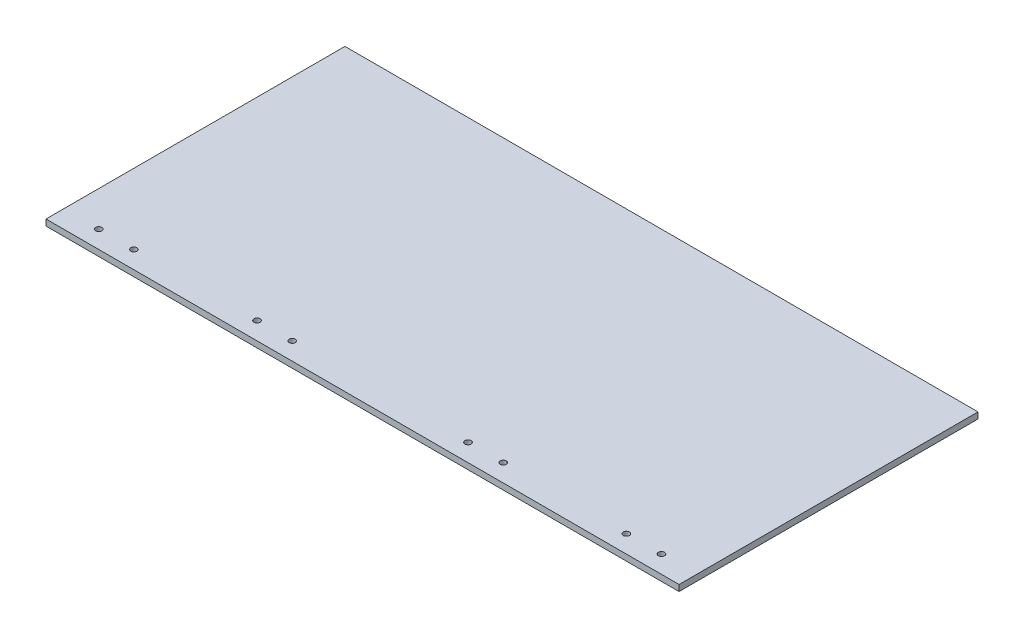
ISO-10303-21;
HEADER;
FILE_DESCRIPTION(('STEP AP214'),'2;1');
FILE_NAME('part.step','',(''),(''),'','','');
FILE_SCHEMA(('AUTOMOTIVE_DESIGN { 1 0 10303 214 1 1 1 1 }'));
ENDSEC;
DATA;
#1=APPLICATION_CONTEXT('core data for automotive mechanical design processes');
#2=APPLICATION_PROTOCOL_DEFINITION('international standard','automotive_design',2000,#1);
#3=PRODUCT_CONTEXT('',#1,'mechanical');
#4=PRODUCT('Part','Part','',(#3));
#5=PRODUCT_RELATED_PRODUCT_CATEGORY('part','',(#4));
#6=PRODUCT_DEFINITION_FORMATION('','',#4);
#7=PRODUCT_DEFINITION_CONTEXT('part definition',#1,'design');
#8=PRODUCT_DEFINITION('design','',#6,#7);
#9=PRODUCT_DEFINITION_SHAPE('','',#8);
#10=(LENGTH_UNIT() NAMED_UNIT(*) SI_UNIT(.MILLI.,.METRE.));
#11=(NAMED_UNIT(*) PLANE_ANGLE_UNIT() SI_UNIT($,.RADIAN.));
#12=(NAMED_UNIT(*) SI_UNIT($,.STERADIAN.) SOLID_ANGLE_UNIT());
#13=UNCERTAINTY_MEASURE_WITH_UNIT(LENGTH_MEASURE(1.E-05),#10,'distance_accuracy_value','');
#14=(GEOMETRIC_REPRESENTATION_CONTEXT(3) GLOBAL_UNCERTAINTY_ASSIGNED_CONTEXT((#13)) GLOBAL_UNIT_ASSIGNED_CONTEXT((#10,
#11,#12)) REPRESENTATION_CONTEXT('',''));
#15=CARTESIAN_POINT('',(0.,0.,0.));
#16=DIRECTION('',(0.,0.,1.));
#17=DIRECTION('',(1.,0.,0.));
#18=AXIS2_PLACEMENT_3D('',#15,#16,#17);
#19=CARTESIAN_POINT('',(0.,3.5,0.));
#20=DIRECTION('',(1.,0.,0.));
#21=DIRECTION('',(0.,0.,-1.));
#22=AXIS2_PLACEMENT_3D('',#19,#20,#21);
#23=PLANE('',#22);
#24=DIRECTION('',(0.,0.,1.));
#25=VECTOR('',#24,1.);
#26=CARTESIAN_POINT('',(0.,0.,0.));
#27=LINE('',#26,#25);
#28=CARTESIAN_POINT('',(0.,0.,-170.));
#29=VERTEX_POINT('',#28);
#30=CARTESIAN_POINT('',(0.,0.,0.));
#31=VERTEX_POINT('',#30);
#32=EDGE_CURVE('E96',#29,#31,#27,.T.);
#33=ORIENTED_EDGE('',*,*,#32,.T.);
#34=DIRECTION('',(0.,-1.,0.));
#35=VECTOR('',#34,1.);
#36=CARTESIAN_POINT('',(0.,3.5,0.));
#37=LINE('',#36,#35);
#38=CARTESIAN_POINT('',(0.,3.5,0.));
#39=VERTEX_POINT('',#38);
#40=EDGE_CURVE('E11',#39,#31,#37,.T.);
#41=ORIENTED_EDGE('',*,*,#40,.F.);
#42=DIRECTION('',(0.,0.,1.));
#43=VECTOR('',#42,1.);
#44=CARTESIAN_POINT('',(0.,3.5,0.));
#45=LINE('',#44,#43);
#46=CARTESIAN_POINT('',(0.,3.5,-170.));
#47=VERTEX_POINT('',#46);
#48=EDGE_CURVE('E84',#47,#39,#45,.T.);
#49=ORIENTED_EDGE('',*,*,#48,.F.);
#50=DIRECTION('',(0.,-1.,0.));
#51=VECTOR('',#50,1.);
#52=CARTESIAN_POINT('',(0.,3.5,-170.));
#53=LINE('',#52,#51);
#54=EDGE_CURVE('E92',#47,#29,#53,.T.);
#55=ORIENTED_EDGE('',*,*,#54,.T.);
#56=EDGE_LOOP('',(#33,#41,#49,#55));
#57=FACE_BOUND('',#56,.T.);
#58=ADVANCED_FACE('F33',(#57),#23,.F.);
#59=CARTESIAN_POINT('',(0.,3.5,0.));
#60=DIRECTION('',(0.,0.,-1.));
#61=DIRECTION('',(-1.,0.,0.));
#62=AXIS2_PLACEMENT_3D('',#59,#60,#61);
#63=PLANE('',#62);
#64=DIRECTION('',(1.,0.,0.));
#65=VECTOR('',#64,1.);
#66=CARTESIAN_POINT('',(0.,0.,0.));
#67=LINE('',#66,#65);
#68=CARTESIAN_POINT('',(360.,0.,0.));
#69=VERTEX_POINT('',#68);
#70=EDGE_CURVE('E88',#31,#69,#67,.T.);
#71=ORIENTED_EDGE('',*,*,#70,.T.);
#72=DIRECTION('',(0.,-1.,0.));
#73=VECTOR('',#72,1.);
#74=CARTESIAN_POINT('',(360.,3.5,0.));
#75=LINE('',#74,#73);
#76=CARTESIAN_POINT('',(360.,3.5,0.));
#77=VERTEX_POINT('',#76);
#78=EDGE_CURVE('E41',#77,#69,#75,.T.);
#79=ORIENTED_EDGE('',*,*,#78,.F.);
#80=DIRECTION('',(1.,0.,0.));
#81=VECTOR('',#80,1.);
#82=CARTESIAN_POINT('',(0.,3.5,0.));
#83=LINE('',#82,#81);
#84=EDGE_CURVE('E79',#39,#77,#83,.T.);
#85=ORIENTED_EDGE('',*,*,#84,.F.);
#86=ORIENTED_EDGE('',*,*,#40,.T.);
#87=EDGE_LOOP('',(#71,#79,#85,#86));
#88=FACE_BOUND('',#87,.T.);
#89=ADVANCED_FACE('F87',(#88),#63,.F.);
#90=CARTESIAN_POINT('',(360.,3.5,0.));
#91=DIRECTION('',(-1.,0.,0.));
#92=DIRECTION('',(0.,0.,1.));
#93=AXIS2_PLACEMENT_3D('',#90,#91,#92);
#94=PLANE('',#93);
#95=DIRECTION('',(0.,0.,-1.));
#96=VECTOR('',#95,1.);
#97=CARTESIAN_POINT('',(360.,0.,0.));
#98=LINE('',#97,#96);
#99=CARTESIAN_POINT('',(360.,0.,-170.));
#100=VERTEX_POINT('',#99);
#101=EDGE_CURVE('E66',#69,#100,#98,.T.);
#102=ORIENTED_EDGE('',*,*,#101,.T.);
#103=DIRECTION('',(0.,-1.,0.));
#104=VECTOR('',#103,1.);
#105=CARTESIAN_POINT('',(360.,3.5,-170.));
#106=LINE('',#105,#104);
#107=CARTESIAN_POINT('',(360.,3.5,-170.));
#108=VERTEX_POINT('',#107);
#109=EDGE_CURVE('E89',#108,#100,#106,.T.);
#110=ORIENTED_EDGE('',*,*,#109,.F.);
#111=DIRECTION('',(0.,0.,-1.));
#112=VECTOR('',#111,1.);
#113=CARTESIAN_POINT('',(360.,3.5,0.));
#114=LINE('',#113,#112);
#115=EDGE_CURVE('E82',#77,#108,#114,.T.);
#116=ORIENTED_EDGE('',*,*,#115,.F.);
#117=ORIENTED_EDGE('',*,*,#78,.T.);
#118=EDGE_LOOP('',(#102,#110,#116,#117));
#119=FACE_BOUND('',#118,.T.);
#120=ADVANCED_FACE('F90',(#119),#94,.F.);
#121=CARTESIAN_POINT('',(0.,3.5,-170.));
#122=DIRECTION('',(0.,0.,1.));
#123=DIRECTION('',(1.,0.,0.));
#124=AXIS2_PLACEMENT_3D('',#121,#122,#123);
#125=PLANE('',#124);
#126=DIRECTION('',(-1.,0.,0.));
#127=VECTOR('',#126,1.);
#128=CARTESIAN_POINT('',(0.,0.,-170.));
#129=LINE('',#128,#127);
#130=EDGE_CURVE('E72',#100,#29,#129,.T.);
#131=ORIENTED_EDGE('',*,*,#130,.T.);
#132=ORIENTED_EDGE('',*,*,#54,.F.);
#133=DIRECTION('',(-1.,0.,0.));
#134=VECTOR('',#133,1.);
#135=CARTESIAN_POINT('',(0.,3.5,-170.));
#136=LINE('',#135,#134);
#137=EDGE_CURVE('E49',#108,#47,#136,.T.);
#138=ORIENTED_EDGE('',*,*,#137,.F.);
#139=ORIENTED_EDGE('',*,*,#109,.T.);
#140=EDGE_LOOP('',(#131,#132,#138,#139));
#141=FACE_BOUND('',#140,.T.);
#142=ADVANCED_FACE('F104',(#141),#125,.F.);
#143=CARTESIAN_POINT('',(0.,3.5,0.));
#144=DIRECTION('',(0.,-1.,0.));
#145=DIRECTION('',(0.,0.,-1.));
#146=AXIS2_PLACEMENT_3D('',#143,#144,#145);
#147=PLANE('',#146);
#148=CARTESIAN_POINT('',(20.,3.5,-10.));
#149=DIRECTION('',(0.,1.,0.));
#150=DIRECTION('',(0.,0.,1.));
#151=AXIS2_PLACEMENT_3D('',#148,#149,#150);
#152=CIRCLE('',#151,1.75);
#153=CARTESIAN_POINT('',(20.,3.5,-8.25));
#154=VERTEX_POINT('',#153);
#155=EDGE_CURVE('E142',#154,#154,#152,.T.);
#156=ORIENTED_EDGE('',*,*,#155,.F.);
#157=EDGE_LOOP('',(#156));
#158=FACE_BOUND('',#157,.T.);
#159=CARTESIAN_POINT('',(130.,3.5,-10.));
#160=DIRECTION('',(0.,1.,0.));
#161=DIRECTION('',(0.,0.,1.));
#162=AXIS2_PLACEMENT_3D('',#159,#160,#161);
#163=CIRCLE('',#162,1.74999999999998);
#164=CARTESIAN_POINT('',(130.,3.5,-8.25000000000002));
#165=VERTEX_POINT('',#164);
#166=EDGE_CURVE('E128',#165,#165,#163,.T.);
#167=ORIENTED_EDGE('',*,*,#166,.F.);
#168=EDGE_LOOP('',(#167));
#169=FACE_BOUND('',#168,.T.);
#170=CARTESIAN_POINT('',(110.,3.5,-10.));
#171=DIRECTION('',(0.,1.,0.));
#172=DIRECTION('',(0.,0.,1.));
#173=AXIS2_PLACEMENT_3D('',#170,#171,#172);
#174=CIRCLE('',#173,1.75);
#175=CARTESIAN_POINT('',(110.,3.5,-8.25));
#176=VERTEX_POINT('',#175);
#177=EDGE_CURVE('E148',#176,#176,#174,.T.);
#178=ORIENTED_EDGE('',*,*,#177,.F.);
#179=EDGE_LOOP('',(#178));
#180=FACE_BOUND('',#179,.T.);
#181=CARTESIAN_POINT('',(40.,3.5,-10.));
#182=DIRECTION('',(0.,1.,0.));
#183=DIRECTION('',(0.,0.,1.));
#184=AXIS2_PLACEMENT_3D('',#181,#182,#183);
#185=CIRCLE('',#184,1.75);
#186=CARTESIAN_POINT('',(40.,3.5,-8.25));
#187=VERTEX_POINT('',#186);
#188=EDGE_CURVE('E129',#187,#187,#185,.T.);
#189=ORIENTED_EDGE('',*,*,#188,.F.);
#190=EDGE_LOOP('',(#189));
#191=FACE_BOUND('',#190,.T.);
#192=CARTESIAN_POINT('',(230.,3.5,-9.99999999999994));
#193=DIRECTION('',(0.,1.,0.));
#194=DIRECTION('',(0.,0.,-1.));
#195=AXIS2_PLACEMENT_3D('',#192,#193,#194);
#196=CIRCLE('',#195,1.74999999999998);
#197=CARTESIAN_POINT('',(230.,3.5,-11.7499999999999));
#198=VERTEX_POINT('',#197);
#199=EDGE_CURVE('E136',#198,#198,#196,.T.);
#200=ORIENTED_EDGE('',*,*,#199,.F.);
#201=EDGE_LOOP('',(#200));
#202=FACE_BOUND('',#201,.T.);
#203=CARTESIAN_POINT('',(250.,3.5,-9.99999999999989));
#204=DIRECTION('',(0.,1.,0.));
#205=DIRECTION('',(0.,0.,-1.));
#206=AXIS2_PLACEMENT_3D('',#203,#204,#205);
#207=CIRCLE('',#206,1.75000000000001);
#208=CARTESIAN_POINT('',(250.,3.5,-11.7499999999999));
#209=VERTEX_POINT('',#208);
#210=EDGE_CURVE('E122',#209,#209,#207,.T.);
#211=ORIENTED_EDGE('',*,*,#210,.F.);
#212=EDGE_LOOP('',(#211));
#213=FACE_BOUND('',#212,.T.);
#214=CARTESIAN_POINT('',(320.,3.5,-9.99999999999983));
#215=DIRECTION('',(0.,1.,0.));
#216=DIRECTION('',(0.,0.,-1.));
#217=AXIS2_PLACEMENT_3D('',#214,#215,#216);
#218=CIRCLE('',#217,1.74999999999998);
#219=CARTESIAN_POINT('',(320.,3.5,-11.7499999999998));
#220=VERTEX_POINT('',#219);
#221=EDGE_CURVE('E116',#220,#220,#218,.T.);
#222=ORIENTED_EDGE('',*,*,#221,.F.);
#223=EDGE_LOOP('',(#222));
#224=FACE_BOUND('',#223,.T.);
#225=CARTESIAN_POINT('',(340.,3.5,-9.99999999999978));
#226=DIRECTION('',(0.,1.,0.));
#227=DIRECTION('',(0.,0.,-1.));
#228=AXIS2_PLACEMENT_3D('',#225,#226,#227);
#229=CIRCLE('',#228,1.75000000000004);
#230=CARTESIAN_POINT('',(340.,3.5,-11.7499999999998));
#231=VERTEX_POINT('',#230);
#232=EDGE_CURVE('E110',#231,#231,#229,.T.);
#233=ORIENTED_EDGE('',*,*,#232,.F.);
#234=EDGE_LOOP('',(#233));
#235=FACE_BOUND('',#234,.T.);
#236=ORIENTED_EDGE('',*,*,#48,.T.);
#237=ORIENTED_EDGE('',*,*,#84,.T.);
#238=ORIENTED_EDGE('',*,*,#115,.T.);
#239=ORIENTED_EDGE('',*,*,#137,.T.);
#240=EDGE_LOOP('',(#236,#237,#238,#239));
#241=FACE_BOUND('',#240,.T.);
#242=ADVANCED_FACE('F80',(#158,#169,#180,#191,#202,#213,#224,#235,#241),#147,.F.);
#243=CARTESIAN_POINT('',(0.,0.,0.));
#244=DIRECTION('',(0.,-1.,0.));
#245=DIRECTION('',(0.,0.,-1.));
#246=AXIS2_PLACEMENT_3D('',#243,#244,#245);
#247=PLANE('',#246);
#248=CARTESIAN_POINT('',(20.,0.,-10.));
#249=DIRECTION('',(0.,1.,0.));
#250=DIRECTION('',(0.,0.,1.));
#251=AXIS2_PLACEMENT_3D('',#248,#249,#250);
#252=CIRCLE('',#251,1.75);
#253=CARTESIAN_POINT('',(20.,0.,-8.25));
#254=VERTEX_POINT('',#253);
#255=EDGE_CURVE('E99',#254,#254,#252,.T.);
#256=ORIENTED_EDGE('',*,*,#255,.T.);
#257=EDGE_LOOP('',(#256));
#258=FACE_BOUND('',#257,.T.);
#259=CARTESIAN_POINT('',(130.,0.,-10.));
#260=DIRECTION('',(0.,1.,0.));
#261=DIRECTION('',(0.,0.,1.));
#262=AXIS2_PLACEMENT_3D('',#259,#260,#261);
#263=CIRCLE('',#262,1.74999999999998);
#264=CARTESIAN_POINT('',(130.,0.,-8.25000000000002));
#265=VERTEX_POINT('',#264);
#266=EDGE_CURVE('E145',#265,#265,#263,.T.);
#267=ORIENTED_EDGE('',*,*,#266,.T.);
#268=EDGE_LOOP('',(#267));
#269=FACE_BOUND('',#268,.T.);
#270=CARTESIAN_POINT('',(110.,0.,-10.));
#271=DIRECTION('',(0.,1.,0.));
#272=DIRECTION('',(0.,0.,1.));
#273=AXIS2_PLACEMENT_3D('',#270,#271,#272);
#274=CIRCLE('',#273,1.75);
#275=CARTESIAN_POINT('',(110.,0.,-8.25));
#276=VERTEX_POINT('',#275);
#277=EDGE_CURVE('E133',#276,#276,#274,.T.);
#278=ORIENTED_EDGE('',*,*,#277,.T.);
#279=EDGE_LOOP('',(#278));
#280=FACE_BOUND('',#279,.T.);
#281=CARTESIAN_POINT('',(40.,0.,-10.));
#282=DIRECTION('',(0.,1.,0.));
#283=DIRECTION('',(0.,0.,1.));
#284=AXIS2_PLACEMENT_3D('',#281,#282,#283);
#285=CIRCLE('',#284,1.75);
#286=CARTESIAN_POINT('',(40.,0.,-8.25));
#287=VERTEX_POINT('',#286);
#288=EDGE_CURVE('E132',#287,#287,#285,.T.);
#289=ORIENTED_EDGE('',*,*,#288,.T.);
#290=EDGE_LOOP('',(#289));
#291=FACE_BOUND('',#290,.T.);
#292=CARTESIAN_POINT('',(230.,0.,-9.99999999999994));
#293=DIRECTION('',(0.,1.,0.));
#294=DIRECTION('',(0.,0.,-1.));
#295=AXIS2_PLACEMENT_3D('',#292,#293,#294);
#296=CIRCLE('',#295,1.74999999999998);
#297=CARTESIAN_POINT('',(230.,0.,-11.7499999999999));
#298=VERTEX_POINT('',#297);
#299=EDGE_CURVE('E139',#298,#298,#296,.T.);
#300=ORIENTED_EDGE('',*,*,#299,.T.);
#301=EDGE_LOOP('',(#300));
#302=FACE_BOUND('',#301,.T.);
#303=CARTESIAN_POINT('',(250.,0.,-9.99999999999989));
#304=DIRECTION('',(0.,1.,0.));
#305=DIRECTION('',(0.,0.,-1.));
#306=AXIS2_PLACEMENT_3D('',#303,#304,#305);
#307=CIRCLE('',#306,1.75000000000001);
#308=CARTESIAN_POINT('',(250.,0.,-11.7499999999999));
#309=VERTEX_POINT('',#308);
#310=EDGE_CURVE('E125',#309,#309,#307,.T.);
#311=ORIENTED_EDGE('',*,*,#310,.T.);
#312=EDGE_LOOP('',(#311));
#313=FACE_BOUND('',#312,.T.);
#314=CARTESIAN_POINT('',(320.,0.,-9.99999999999983));
#315=DIRECTION('',(0.,1.,0.));
#316=DIRECTION('',(0.,0.,-1.));
#317=AXIS2_PLACEMENT_3D('',#314,#315,#316);
#318=CIRCLE('',#317,1.74999999999998);
#319=CARTESIAN_POINT('',(320.,0.,-11.7499999999998));
#320=VERTEX_POINT('',#319);
#321=EDGE_CURVE('E119',#320,#320,#318,.T.);
#322=ORIENTED_EDGE('',*,*,#321,.T.);
#323=EDGE_LOOP('',(#322));
#324=FACE_BOUND('',#323,.T.);
#325=CARTESIAN_POINT('',(340.,0.,-9.99999999999978));
#326=DIRECTION('',(0.,1.,0.));
#327=DIRECTION('',(0.,0.,-1.));
#328=AXIS2_PLACEMENT_3D('',#325,#326,#327);
#329=CIRCLE('',#328,1.75000000000004);
#330=CARTESIAN_POINT('',(340.,0.,-11.7499999999998));
#331=VERTEX_POINT('',#330);
#332=EDGE_CURVE('E113',#331,#331,#329,.T.);
#333=ORIENTED_EDGE('',*,*,#332,.T.);
#334=EDGE_LOOP('',(#333));
#335=FACE_BOUND('',#334,.T.);
#336=ORIENTED_EDGE('',*,*,#32,.F.);
#337=ORIENTED_EDGE('',*,*,#130,.F.);
#338=ORIENTED_EDGE('',*,*,#101,.F.);
#339=ORIENTED_EDGE('',*,*,#70,.F.);
#340=EDGE_LOOP('',(#336,#337,#338,#339));
#341=FACE_BOUND('',#340,.T.);
#342=ADVANCED_FACE('F107',(#258,#269,#280,#291,#302,#313,#324,#335,#341),#247,.T.);
#343=CARTESIAN_POINT('',(340.,0.,-9.99999999999978));
#344=DIRECTION('',(0.,1.,0.));
#345=DIRECTION('',(0.,0.,1.));
#346=AXIS2_PLACEMENT_3D('',#343,#344,#345);
#347=CYLINDRICAL_SURFACE('',#346,1.75000000000004);
#348=ORIENTED_EDGE('',*,*,#332,.F.);
#349=EDGE_LOOP('',(#348));
#350=FACE_BOUND('',#349,.T.);
#351=ORIENTED_EDGE('',*,*,#232,.T.);
#352=EDGE_LOOP('',(#351));
#353=FACE_BOUND('',#352,.T.);
#354=ADVANCED_FACE('F184',(#350,#353),#347,.F.);
#355=CARTESIAN_POINT('',(320.,0.,-9.99999999999983));
#356=DIRECTION('',(0.,1.,0.));
#357=DIRECTION('',(0.,0.,1.));
#358=AXIS2_PLACEMENT_3D('',#355,#356,#357);
#359=CYLINDRICAL_SURFACE('',#358,1.74999999999998);
#360=ORIENTED_EDGE('',*,*,#321,.F.);
#361=EDGE_LOOP('',(#360));
#362=FACE_BOUND('',#361,.T.);
#363=ORIENTED_EDGE('',*,*,#221,.T.);
#364=EDGE_LOOP('',(#363));
#365=FACE_BOUND('',#364,.T.);
#366=ADVANCED_FACE('F186',(#362,#365),#359,.F.);
#367=CARTESIAN_POINT('',(250.,0.,-9.99999999999989));
#368=DIRECTION('',(0.,1.,0.));
#369=DIRECTION('',(0.,0.,1.));
#370=AXIS2_PLACEMENT_3D('',#367,#368,#369);
#371=CYLINDRICAL_SURFACE('',#370,1.75000000000001);
#372=ORIENTED_EDGE('',*,*,#310,.F.);
#373=EDGE_LOOP('',(#372));
#374=FACE_BOUND('',#373,.T.);
#375=ORIENTED_EDGE('',*,*,#210,.T.);
#376=EDGE_LOOP('',(#375));
#377=FACE_BOUND('',#376,.T.);
#378=ADVANCED_FACE('F193',(#374,#377),#371,.F.);
#379=CARTESIAN_POINT('',(230.,0.,-9.99999999999994));
#380=DIRECTION('',(0.,1.,0.));
#381=DIRECTION('',(0.,0.,1.));
#382=AXIS2_PLACEMENT_3D('',#379,#380,#381);
#383=CYLINDRICAL_SURFACE('',#382,1.74999999999998);
#384=ORIENTED_EDGE('',*,*,#299,.F.);
#385=EDGE_LOOP('',(#384));
#386=FACE_BOUND('',#385,.T.);
#387=ORIENTED_EDGE('',*,*,#199,.T.);
#388=EDGE_LOOP('',(#387));
#389=FACE_BOUND('',#388,.T.);
#390=ADVANCED_FACE('F239',(#386,#389),#383,.F.);
#391=CARTESIAN_POINT('',(40.,0.,-10.));
#392=DIRECTION('',(0.,1.,0.));
#393=DIRECTION('',(0.,0.,1.));
#394=AXIS2_PLACEMENT_3D('',#391,#392,#393);
#395=CYLINDRICAL_SURFACE('',#394,1.75);
#396=ORIENTED_EDGE('',*,*,#288,.F.);
#397=EDGE_LOOP('',(#396));
#398=FACE_BOUND('',#397,.T.);
#399=ORIENTED_EDGE('',*,*,#188,.T.);
#400=EDGE_LOOP('',(#399));
#401=FACE_BOUND('',#400,.T.);
#402=ADVANCED_FACE('F249',(#398,#401),#395,.F.);
#403=CARTESIAN_POINT('',(110.,0.,-10.));
#404=DIRECTION('',(0.,1.,0.));
#405=DIRECTION('',(0.,0.,1.));
#406=AXIS2_PLACEMENT_3D('',#403,#404,#405);
#407=CYLINDRICAL_SURFACE('',#406,1.75);
#408=ORIENTED_EDGE('',*,*,#277,.F.);
#409=EDGE_LOOP('',(#408));
#410=FACE_BOUND('',#409,.T.);
#411=ORIENTED_EDGE('',*,*,#177,.T.);
#412=EDGE_LOOP('',(#411));
#413=FACE_BOUND('',#412,.T.);
#414=ADVANCED_FACE('F259',(#410,#413),#407,.F.);
#415=CARTESIAN_POINT('',(130.,0.,-10.));
#416=DIRECTION('',(0.,1.,0.));
#417=DIRECTION('',(0.,0.,1.));
#418=AXIS2_PLACEMENT_3D('',#415,#416,#417);
#419=CYLINDRICAL_SURFACE('',#418,1.74999999999998);
#420=ORIENTED_EDGE('',*,*,#266,.F.);
#421=EDGE_LOOP('',(#420));
#422=FACE_BOUND('',#421,.T.);
#423=ORIENTED_EDGE('',*,*,#166,.T.);
#424=EDGE_LOOP('',(#423));
#425=FACE_BOUND('',#424,.T.);
#426=ADVANCED_FACE('F163',(#422,#425),#419,.F.);
#427=CARTESIAN_POINT('',(20.,0.,-10.));
#428=DIRECTION('',(0.,1.,0.));
#429=DIRECTION('',(0.,0.,1.));
#430=AXIS2_PLACEMENT_3D('',#427,#428,#429);
#431=CYLINDRICAL_SURFACE('',#430,1.75);
#432=ORIENTED_EDGE('',*,*,#255,.F.);
#433=EDGE_LOOP('',(#432));
#434=FACE_BOUND('',#433,.T.);
#435=ORIENTED_EDGE('',*,*,#155,.T.);
#436=EDGE_LOOP('',(#435));
#437=FACE_BOUND('',#436,.T.);
#438=ADVANCED_FACE('F160',(#434,#437),#431,.F.);
#439=CLOSED_SHELL('',(#58,#89,#120,#142,#242,#342,#354,#366,#378,#390,#402,#414,#426,#438));
#440=MANIFOLD_SOLID_BREP('B2',#439);
#441=ADVANCED_BREP_SHAPE_REPRESENTATION('',(#18,#440),#14);
#442=SHAPE_DEFINITION_REPRESENTATION(#9,#441);
ENDSEC;
END-ISO-10303-21;
